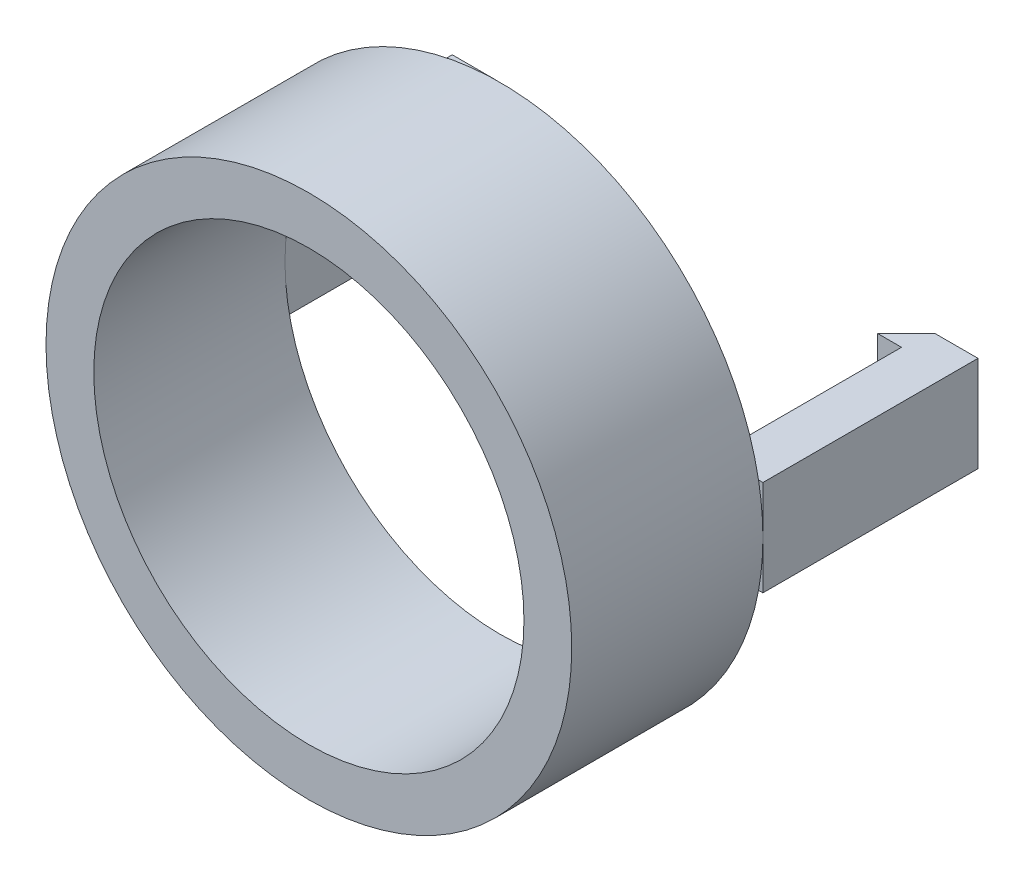
ISO-10303-21;
HEADER;
FILE_DESCRIPTION(('STEP AP214'),'2;1');
FILE_NAME('part.step','',(''),(''),'','','');
FILE_SCHEMA(('AUTOMOTIVE_DESIGN { 1 0 10303 214 1 1 1 1 }'));
ENDSEC;
DATA;
#1=APPLICATION_CONTEXT('core data for automotive mechanical design processes');
#2=APPLICATION_PROTOCOL_DEFINITION('international standard','automotive_design',2000,#1);
#3=PRODUCT_CONTEXT('',#1,'mechanical');
#4=PRODUCT('Part','Part','',(#3));
#5=PRODUCT_RELATED_PRODUCT_CATEGORY('part','',(#4));
#6=PRODUCT_DEFINITION_FORMATION('','',#4);
#7=PRODUCT_DEFINITION_CONTEXT('part definition',#1,'design');
#8=PRODUCT_DEFINITION('design','',#6,#7);
#9=PRODUCT_DEFINITION_SHAPE('','',#8);
#10=(LENGTH_UNIT() NAMED_UNIT(*) SI_UNIT(.MILLI.,.METRE.));
#11=(NAMED_UNIT(*) PLANE_ANGLE_UNIT() SI_UNIT($,.RADIAN.));
#12=(NAMED_UNIT(*) SI_UNIT($,.STERADIAN.) SOLID_ANGLE_UNIT());
#13=UNCERTAINTY_MEASURE_WITH_UNIT(LENGTH_MEASURE(1.E-05),#10,'distance_accuracy_value','');
#14=(GEOMETRIC_REPRESENTATION_CONTEXT(3) GLOBAL_UNCERTAINTY_ASSIGNED_CONTEXT((#13)) GLOBAL_UNIT_ASSIGNED_CONTEXT((#10,
#11,#12)) REPRESENTATION_CONTEXT('',''));
#15=CARTESIAN_POINT('',(0.,0.,0.));
#16=DIRECTION('',(0.,0.,1.));
#17=DIRECTION('',(1.,0.,0.));
#18=AXIS2_PLACEMENT_3D('',#15,#16,#17);
#19=CARTESIAN_POINT('',(0.,0.,0.));
#20=DIRECTION('',(0.,0.,1.));
#21=DIRECTION('',(1.,0.,0.));
#22=AXIS2_PLACEMENT_3D('',#19,#20,#21);
#23=PLANE('',#22);
#24=DIRECTION('',(0.,-1.,0.));
#25=VECTOR('',#24,1.);
#26=CARTESIAN_POINT('',(9.,2.,0.));
#27=LINE('',#26,#25);
#28=CARTESIAN_POINT('',(9.,0.,0.));
#29=VERTEX_POINT('',#28);
#30=CARTESIAN_POINT('',(9.,-2.,0.));
#31=VERTEX_POINT('',#30);
#32=EDGE_CURVE('E171',#29,#31,#27,.T.);
#33=ORIENTED_EDGE('',*,*,#32,.T.);
#34=DIRECTION('',(1.,0.,0.));
#35=VECTOR('',#34,1.);
#36=CARTESIAN_POINT('',(9.,-2.,0.));
#37=LINE('',#36,#35);
#38=CARTESIAN_POINT('',(10.816653826392,-2.,0.));
#39=VERTEX_POINT('',#38);
#40=EDGE_CURVE('E193',#31,#39,#37,.T.);
#41=ORIENTED_EDGE('',*,*,#40,.T.);
#42=CARTESIAN_POINT('',(0.,0.,0.));
#43=DIRECTION('',(0.,0.,1.));
#44=DIRECTION('',(1.,0.,0.));
#45=AXIS2_PLACEMENT_3D('',#42,#43,#44);
#46=CIRCLE('',#45,11.);
#47=CARTESIAN_POINT('',(-10.816653826392,-2.,0.));
#48=VERTEX_POINT('',#47);
#49=EDGE_CURVE('E278',#48,#39,#46,.T.);
#50=ORIENTED_EDGE('',*,*,#49,.F.);
#51=DIRECTION('',(1.,0.,0.));
#52=VECTOR('',#51,1.);
#53=CARTESIAN_POINT('',(-9.,-2.,0.));
#54=LINE('',#53,#52);
#55=CARTESIAN_POINT('',(-9.,-2.,0.));
#56=VERTEX_POINT('',#55);
#57=EDGE_CURVE('E11',#48,#56,#54,.T.);
#58=ORIENTED_EDGE('',*,*,#57,.T.);
#59=DIRECTION('',(0.,-1.,0.));
#60=VECTOR('',#59,1.);
#61=CARTESIAN_POINT('',(-9.,2.,0.));
#62=LINE('',#61,#60);
#63=CARTESIAN_POINT('',(-9.,0.,0.));
#64=VERTEX_POINT('',#63);
#65=EDGE_CURVE('E45',#64,#56,#62,.T.);
#66=ORIENTED_EDGE('',*,*,#65,.F.);
#67=CARTESIAN_POINT('',(0.,0.,0.));
#68=DIRECTION('',(0.,0.,1.));
#69=DIRECTION('',(1.,0.,0.));
#70=AXIS2_PLACEMENT_3D('',#67,#68,#69);
#71=CIRCLE('',#70,9.);
#72=EDGE_CURVE('E266',#64,#29,#71,.T.);
#73=ORIENTED_EDGE('',*,*,#72,.T.);
#74=EDGE_LOOP('',(#33,#41,#50,#58,#66,#73));
#75=FACE_BOUND('',#74,.T.);
#76=ADVANCED_FACE('F36',(#75),#23,.F.);
#77=CARTESIAN_POINT('',(0.,0.,8.));
#78=DIRECTION('',(0.,0.,1.));
#79=DIRECTION('',(1.,0.,0.));
#80=AXIS2_PLACEMENT_3D('',#77,#78,#79);
#81=PLANE('',#80);
#82=CARTESIAN_POINT('',(0.,0.,8.));
#83=DIRECTION('',(0.,0.,1.));
#84=DIRECTION('',(1.,0.,0.));
#85=AXIS2_PLACEMENT_3D('',#82,#83,#84);
#86=CIRCLE('',#85,11.);
#87=CARTESIAN_POINT('',(11.,0.,8.));
#88=VERTEX_POINT('',#87);
#89=EDGE_CURVE('E268',#88,#88,#86,.T.);
#90=ORIENTED_EDGE('',*,*,#89,.T.);
#91=EDGE_LOOP('',(#90));
#92=FACE_BOUND('',#91,.T.);
#93=CARTESIAN_POINT('',(0.,0.,8.));
#94=DIRECTION('',(0.,0.,1.));
#95=DIRECTION('',(1.,0.,0.));
#96=AXIS2_PLACEMENT_3D('',#93,#94,#95);
#97=CIRCLE('',#96,9.);
#98=CARTESIAN_POINT('',(9.,0.,8.));
#99=VERTEX_POINT('',#98);
#100=EDGE_CURVE('E263',#99,#99,#97,.T.);
#101=ORIENTED_EDGE('',*,*,#100,.F.);
#102=EDGE_LOOP('',(#101));
#103=FACE_BOUND('',#102,.T.);
#104=ADVANCED_FACE('F318',(#92,#103),#81,.T.);
#105=CARTESIAN_POINT('',(10.816653826392,2.,0.));
#106=VERTEX_POINT('',#105);
#107=CARTESIAN_POINT('',(-10.816653826392,2.,0.));
#108=VERTEX_POINT('',#107);
#109=EDGE_CURVE('E178',#106,#108,#46,.T.);
#110=ORIENTED_EDGE('',*,*,#109,.F.);
#111=DIRECTION('',(1.,0.,0.));
#112=VECTOR('',#111,1.);
#113=CARTESIAN_POINT('',(9.,2.,0.));
#114=LINE('',#113,#112);
#115=CARTESIAN_POINT('',(9.,2.,0.));
#116=VERTEX_POINT('',#115);
#117=EDGE_CURVE('E156',#116,#106,#114,.T.);
#118=ORIENTED_EDGE('',*,*,#117,.F.);
#119=EDGE_CURVE('E167',#116,#29,#27,.T.);
#120=ORIENTED_EDGE('',*,*,#119,.T.);
#121=EDGE_CURVE('E262',#29,#64,#71,.T.);
#122=ORIENTED_EDGE('',*,*,#121,.T.);
#123=CARTESIAN_POINT('',(-9.,2.,0.));
#124=VERTEX_POINT('',#123);
#125=EDGE_CURVE('E259',#124,#64,#62,.T.);
#126=ORIENTED_EDGE('',*,*,#125,.F.);
#127=DIRECTION('',(1.,0.,0.));
#128=VECTOR('',#127,1.);
#129=CARTESIAN_POINT('',(-9.,2.,0.));
#130=LINE('',#129,#128);
#131=EDGE_CURVE('E222',#108,#124,#130,.T.);
#132=ORIENTED_EDGE('',*,*,#131,.F.);
#133=EDGE_LOOP('',(#110,#118,#120,#122,#126,#132));
#134=FACE_BOUND('',#133,.T.);
#135=ADVANCED_FACE('F176',(#134),#23,.F.);
#136=CARTESIAN_POINT('',(0.,0.,8.));
#137=DIRECTION('',(0.,0.,-1.));
#138=DIRECTION('',(-1.,0.,0.));
#139=AXIS2_PLACEMENT_3D('',#136,#137,#138);
#140=CYLINDRICAL_SURFACE('',#139,11.);
#141=ORIENTED_EDGE('',*,*,#89,.F.);
#142=EDGE_LOOP('',(#141));
#143=FACE_BOUND('',#142,.T.);
#144=CARTESIAN_POINT('',(-11.,0.,0.));
#145=VERTEX_POINT('',#144);
#146=EDGE_CURVE('E40',#108,#145,#46,.T.);
#147=ORIENTED_EDGE('',*,*,#146,.T.);
#148=EDGE_CURVE('E273',#145,#48,#46,.T.);
#149=ORIENTED_EDGE('',*,*,#148,.T.);
#150=ORIENTED_EDGE('',*,*,#49,.T.);
#151=CARTESIAN_POINT('',(0.,0.,0.));
#152=DIRECTION('',(0.,0.,-1.));
#153=DIRECTION('',(-1.,0.,0.));
#154=AXIS2_PLACEMENT_3D('',#151,#152,#153);
#155=CIRCLE('',#154,11.);
#156=CARTESIAN_POINT('',(11.,0.,0.));
#157=VERTEX_POINT('',#156);
#158=EDGE_CURVE('E174',#157,#39,#155,.T.);
#159=ORIENTED_EDGE('',*,*,#158,.F.);
#160=EDGE_CURVE('E216',#106,#157,#155,.T.);
#161=ORIENTED_EDGE('',*,*,#160,.F.);
#162=ORIENTED_EDGE('',*,*,#109,.T.);
#163=EDGE_LOOP('',(#147,#149,#150,#159,#161,#162));
#164=FACE_BOUND('',#163,.T.);
#165=ADVANCED_FACE('F38',(#143,#164),#140,.T.);
#166=CARTESIAN_POINT('',(0.,0.,8.));
#167=DIRECTION('',(0.,0.,-1.));
#168=DIRECTION('',(-1.,0.,0.));
#169=AXIS2_PLACEMENT_3D('',#166,#167,#168);
#170=CYLINDRICAL_SURFACE('',#169,9.);
#171=ORIENTED_EDGE('',*,*,#100,.T.);
#172=EDGE_LOOP('',(#171));
#173=FACE_BOUND('',#172,.T.);
#174=ORIENTED_EDGE('',*,*,#72,.F.);
#175=ORIENTED_EDGE('',*,*,#121,.F.);
#176=EDGE_LOOP('',(#174,#175));
#177=FACE_BOUND('',#176,.T.);
#178=ADVANCED_FACE('F327',(#173,#177),#170,.F.);
#179=CARTESIAN_POINT('',(-9.,2.,0.));
#180=DIRECTION('',(0.,0.,-1.));
#181=DIRECTION('',(-1.,0.,0.));
#182=AXIS2_PLACEMENT_3D('',#179,#180,#181);
#183=PLANE('',#182);
#184=ORIENTED_EDGE('',*,*,#146,.F.);
#185=CARTESIAN_POINT('',(-11.,2.,0.));
#186=VERTEX_POINT('',#185);
#187=EDGE_CURVE('E217',#186,#108,#130,.T.);
#188=ORIENTED_EDGE('',*,*,#187,.F.);
#189=DIRECTION('',(0.,-1.,0.));
#190=VECTOR('',#189,1.);
#191=CARTESIAN_POINT('',(-11.,2.,0.));
#192=LINE('',#191,#190);
#193=EDGE_CURVE('E244',#186,#145,#192,.T.);
#194=ORIENTED_EDGE('',*,*,#193,.T.);
#195=EDGE_LOOP('',(#184,#188,#194));
#196=FACE_BOUND('',#195,.T.);
#197=ADVANCED_FACE('F332',(#196),#183,.F.);
#198=ORIENTED_EDGE('',*,*,#148,.F.);
#199=CARTESIAN_POINT('',(-11.,-2.,0.));
#200=VERTEX_POINT('',#199);
#201=EDGE_CURVE('E231',#145,#200,#192,.T.);
#202=ORIENTED_EDGE('',*,*,#201,.T.);
#203=EDGE_CURVE('E47',#200,#48,#54,.T.);
#204=ORIENTED_EDGE('',*,*,#203,.T.);
#205=EDGE_LOOP('',(#198,#202,#204));
#206=FACE_BOUND('',#205,.T.);
#207=ADVANCED_FACE('F338',(#206),#183,.F.);
#208=CARTESIAN_POINT('',(-9.,2.,-7.8));
#209=DIRECTION('',(-1.,0.,0.));
#210=DIRECTION('',(0.,0.,1.));
#211=AXIS2_PLACEMENT_3D('',#208,#209,#210);
#212=PLANE('',#211);
#213=DIRECTION('',(0.,0.,-1.));
#214=VECTOR('',#213,1.);
#215=CARTESIAN_POINT('',(-9.,-2.,-7.8));
#216=LINE('',#215,#214);
#217=CARTESIAN_POINT('',(-9.,-2.,-7.8));
#218=VERTEX_POINT('',#217);
#219=EDGE_CURVE('E234',#56,#218,#216,.T.);
#220=ORIENTED_EDGE('',*,*,#219,.T.);
#221=DIRECTION('',(0.,-1.,0.));
#222=VECTOR('',#221,1.);
#223=CARTESIAN_POINT('',(-9.,2.,-7.8));
#224=LINE('',#223,#222);
#225=CARTESIAN_POINT('',(-9.,2.,-7.8));
#226=VERTEX_POINT('',#225);
#227=EDGE_CURVE('E256',#226,#218,#224,.T.);
#228=ORIENTED_EDGE('',*,*,#227,.F.);
#229=DIRECTION('',(0.,0.,-1.));
#230=VECTOR('',#229,1.);
#231=CARTESIAN_POINT('',(-9.,2.,-7.8));
#232=LINE('',#231,#230);
#233=EDGE_CURVE('E220',#124,#226,#232,.T.);
#234=ORIENTED_EDGE('',*,*,#233,.F.);
#235=ORIENTED_EDGE('',*,*,#125,.T.);
#236=ORIENTED_EDGE('',*,*,#65,.T.);
#237=EDGE_LOOP('',(#220,#228,#234,#235,#236));
#238=FACE_BOUND('',#237,.T.);
#239=ADVANCED_FACE('F344',(#238),#212,.F.);
#240=CARTESIAN_POINT('',(-8.,2.,-7.8));
#241=DIRECTION('',(0.,0.,-1.));
#242=DIRECTION('',(-1.,0.,0.));
#243=AXIS2_PLACEMENT_3D('',#240,#241,#242);
#244=PLANE('',#243);
#245=DIRECTION('',(1.,0.,0.));
#246=VECTOR('',#245,1.);
#247=CARTESIAN_POINT('',(-8.,-2.,-7.8));
#248=LINE('',#247,#246);
#249=CARTESIAN_POINT('',(-8.,-2.,-7.8));
#250=VERTEX_POINT('',#249);
#251=EDGE_CURVE('E236',#218,#250,#248,.T.);
#252=ORIENTED_EDGE('',*,*,#251,.T.);
#253=DIRECTION('',(0.,-1.,0.));
#254=VECTOR('',#253,1.);
#255=CARTESIAN_POINT('',(-8.,2.,-7.8));
#256=LINE('',#255,#254);
#257=CARTESIAN_POINT('',(-8.,2.,-7.8));
#258=VERTEX_POINT('',#257);
#259=EDGE_CURVE('E253',#258,#250,#256,.T.);
#260=ORIENTED_EDGE('',*,*,#259,.F.);
#261=DIRECTION('',(1.,0.,0.));
#262=VECTOR('',#261,1.);
#263=CARTESIAN_POINT('',(-8.,2.,-7.8));
#264=LINE('',#263,#262);
#265=EDGE_CURVE('E224',#226,#258,#264,.T.);
#266=ORIENTED_EDGE('',*,*,#265,.F.);
#267=ORIENTED_EDGE('',*,*,#227,.T.);
#268=EDGE_LOOP('',(#252,#260,#266,#267));
#269=FACE_BOUND('',#268,.T.);
#270=ADVANCED_FACE('F348',(#269),#244,.F.);
#271=CARTESIAN_POINT('',(-9.20000000000001,2.,-9.));
#272=DIRECTION('',(-0.707106781186544,0.,0.707106781186551));
#273=DIRECTION('',(0.707106781186551,0.,0.707106781186544));
#274=AXIS2_PLACEMENT_3D('',#271,#272,#273);
#275=PLANE('',#274);
#276=DIRECTION('',(-0.707106781186551,0.,-0.707106781186544));
#277=VECTOR('',#276,1.);
#278=CARTESIAN_POINT('',(-9.20000000000001,-2.,-9.));
#279=LINE('',#278,#277);
#280=CARTESIAN_POINT('',(-9.20000000000001,-2.,-9.));
#281=VERTEX_POINT('',#280);
#282=EDGE_CURVE('E238',#250,#281,#279,.T.);
#283=ORIENTED_EDGE('',*,*,#282,.T.);
#284=DIRECTION('',(0.,-1.,0.));
#285=VECTOR('',#284,1.);
#286=CARTESIAN_POINT('',(-9.20000000000001,2.,-9.));
#287=LINE('',#286,#285);
#288=CARTESIAN_POINT('',(-9.20000000000001,2.,-9.));
#289=VERTEX_POINT('',#288);
#290=EDGE_CURVE('E250',#289,#281,#287,.T.);
#291=ORIENTED_EDGE('',*,*,#290,.F.);
#292=DIRECTION('',(-0.707106781186551,0.,-0.707106781186544));
#293=VECTOR('',#292,1.);
#294=CARTESIAN_POINT('',(-9.20000000000001,2.,-9.));
#295=LINE('',#294,#293);
#296=EDGE_CURVE('E226',#258,#289,#295,.T.);
#297=ORIENTED_EDGE('',*,*,#296,.F.);
#298=ORIENTED_EDGE('',*,*,#259,.T.);
#299=EDGE_LOOP('',(#283,#291,#297,#298));
#300=FACE_BOUND('',#299,.T.);
#301=ADVANCED_FACE('F352',(#300),#275,.F.);
#302=CARTESIAN_POINT('',(-11.,2.,-9.));
#303=DIRECTION('',(0.,0.,1.));
#304=DIRECTION('',(1.,0.,0.));
#305=AXIS2_PLACEMENT_3D('',#302,#303,#304);
#306=PLANE('',#305);
#307=DIRECTION('',(-1.,0.,0.));
#308=VECTOR('',#307,1.);
#309=CARTESIAN_POINT('',(-11.,-2.,-9.));
#310=LINE('',#309,#308);
#311=CARTESIAN_POINT('',(-11.,-2.,-9.));
#312=VERTEX_POINT('',#311);
#313=EDGE_CURVE('E240',#281,#312,#310,.T.);
#314=ORIENTED_EDGE('',*,*,#313,.T.);
#315=DIRECTION('',(0.,-1.,0.));
#316=VECTOR('',#315,1.);
#317=CARTESIAN_POINT('',(-11.,2.,-9.));
#318=LINE('',#317,#316);
#319=CARTESIAN_POINT('',(-11.,2.,-9.));
#320=VERTEX_POINT('',#319);
#321=EDGE_CURVE('E247',#320,#312,#318,.T.);
#322=ORIENTED_EDGE('',*,*,#321,.F.);
#323=DIRECTION('',(-1.,0.,0.));
#324=VECTOR('',#323,1.);
#325=CARTESIAN_POINT('',(-11.,2.,-9.));
#326=LINE('',#325,#324);
#327=EDGE_CURVE('E228',#289,#320,#326,.T.);
#328=ORIENTED_EDGE('',*,*,#327,.F.);
#329=ORIENTED_EDGE('',*,*,#290,.T.);
#330=EDGE_LOOP('',(#314,#322,#328,#329));
#331=FACE_BOUND('',#330,.T.);
#332=ADVANCED_FACE('F356',(#331),#306,.F.);
#333=CARTESIAN_POINT('',(-11.,2.,0.));
#334=DIRECTION('',(1.,0.,0.));
#335=DIRECTION('',(0.,0.,-1.));
#336=AXIS2_PLACEMENT_3D('',#333,#334,#335);
#337=PLANE('',#336);
#338=DIRECTION('',(0.,0.,1.));
#339=VECTOR('',#338,1.);
#340=CARTESIAN_POINT('',(-11.,-2.,0.));
#341=LINE('',#340,#339);
#342=EDGE_CURVE('E221',#312,#200,#341,.T.);
#343=ORIENTED_EDGE('',*,*,#342,.T.);
#344=ORIENTED_EDGE('',*,*,#201,.F.);
#345=ORIENTED_EDGE('',*,*,#193,.F.);
#346=DIRECTION('',(0.,0.,1.));
#347=VECTOR('',#346,1.);
#348=CARTESIAN_POINT('',(-11.,2.,0.));
#349=LINE('',#348,#347);
#350=EDGE_CURVE('E230',#320,#186,#349,.T.);
#351=ORIENTED_EDGE('',*,*,#350,.F.);
#352=ORIENTED_EDGE('',*,*,#321,.T.);
#353=EDGE_LOOP('',(#343,#344,#345,#351,#352));
#354=FACE_BOUND('',#353,.T.);
#355=ADVANCED_FACE('F360',(#354),#337,.F.);
#356=CARTESIAN_POINT('',(0.,2.,0.));
#357=DIRECTION('',(0.,-1.,0.));
#358=DIRECTION('',(0.,0.,-1.));
#359=AXIS2_PLACEMENT_3D('',#356,#357,#358);
#360=PLANE('',#359);
#361=ORIENTED_EDGE('',*,*,#187,.T.);
#362=ORIENTED_EDGE('',*,*,#131,.T.);
#363=ORIENTED_EDGE('',*,*,#233,.T.);
#364=ORIENTED_EDGE('',*,*,#265,.T.);
#365=ORIENTED_EDGE('',*,*,#296,.T.);
#366=ORIENTED_EDGE('',*,*,#327,.T.);
#367=ORIENTED_EDGE('',*,*,#350,.T.);
#368=EDGE_LOOP('',(#361,#362,#363,#364,#365,#366,#367));
#369=FACE_BOUND('',#368,.T.);
#370=ADVANCED_FACE('F364',(#369),#360,.F.);
#371=CARTESIAN_POINT('',(0.,-2.,0.));
#372=DIRECTION('',(0.,-1.,0.));
#373=DIRECTION('',(0.,0.,-1.));
#374=AXIS2_PLACEMENT_3D('',#371,#372,#373);
#375=PLANE('',#374);
#376=ORIENTED_EDGE('',*,*,#203,.F.);
#377=ORIENTED_EDGE('',*,*,#342,.F.);
#378=ORIENTED_EDGE('',*,*,#313,.F.);
#379=ORIENTED_EDGE('',*,*,#282,.F.);
#380=ORIENTED_EDGE('',*,*,#251,.F.);
#381=ORIENTED_EDGE('',*,*,#219,.F.);
#382=ORIENTED_EDGE('',*,*,#57,.F.);
#383=EDGE_LOOP('',(#376,#377,#378,#379,#380,#381,#382));
#384=FACE_BOUND('',#383,.T.);
#385=ADVANCED_FACE('F315',(#384),#375,.T.);
#386=CARTESIAN_POINT('',(9.,2.,0.));
#387=DIRECTION('',(0.,0.,-1.));
#388=DIRECTION('',(-1.,0.,0.));
#389=AXIS2_PLACEMENT_3D('',#386,#387,#388);
#390=PLANE('',#389);
#391=CARTESIAN_POINT('',(11.,2.,0.));
#392=VERTEX_POINT('',#391);
#393=EDGE_CURVE('E163',#106,#392,#114,.T.);
#394=ORIENTED_EDGE('',*,*,#393,.F.);
#395=ORIENTED_EDGE('',*,*,#160,.T.);
#396=DIRECTION('',(0.,-1.,0.));
#397=VECTOR('',#396,1.);
#398=CARTESIAN_POINT('',(11.,2.,0.));
#399=LINE('',#398,#397);
#400=EDGE_CURVE('E54',#392,#157,#399,.T.);
#401=ORIENTED_EDGE('',*,*,#400,.F.);
#402=EDGE_LOOP('',(#394,#395,#401));
#403=FACE_BOUND('',#402,.T.);
#404=ADVANCED_FACE('F307',(#403),#390,.F.);
#405=CARTESIAN_POINT('',(9.,2.,-7.8));
#406=DIRECTION('',(1.,0.,0.));
#407=DIRECTION('',(0.,0.,-1.));
#408=AXIS2_PLACEMENT_3D('',#405,#406,#407);
#409=PLANE('',#408);
#410=DIRECTION('',(0.,0.,1.));
#411=VECTOR('',#410,1.);
#412=CARTESIAN_POINT('',(9.,-2.,-7.8));
#413=LINE('',#412,#411);
#414=CARTESIAN_POINT('',(9.,-2.,-7.8));
#415=VERTEX_POINT('',#414);
#416=EDGE_CURVE('E190',#415,#31,#413,.T.);
#417=ORIENTED_EDGE('',*,*,#416,.T.);
#418=ORIENTED_EDGE('',*,*,#32,.F.);
#419=ORIENTED_EDGE('',*,*,#119,.F.);
#420=DIRECTION('',(0.,0.,1.));
#421=VECTOR('',#420,1.);
#422=CARTESIAN_POINT('',(9.,2.,-7.8));
#423=LINE('',#422,#421);
#424=CARTESIAN_POINT('',(9.,2.,-7.8));
#425=VERTEX_POINT('',#424);
#426=EDGE_CURVE('E152',#425,#116,#423,.T.);
#427=ORIENTED_EDGE('',*,*,#426,.F.);
#428=DIRECTION('',(0.,-1.,0.));
#429=VECTOR('',#428,1.);
#430=CARTESIAN_POINT('',(9.,2.,-7.8));
#431=LINE('',#430,#429);
#432=EDGE_CURVE('E189',#425,#415,#431,.T.);
#433=ORIENTED_EDGE('',*,*,#432,.T.);
#434=EDGE_LOOP('',(#417,#418,#419,#427,#433));
#435=FACE_BOUND('',#434,.T.);
#436=ADVANCED_FACE('F169',(#435),#409,.F.);
#437=CARTESIAN_POINT('',(11.,-2.,0.));
#438=VERTEX_POINT('',#437);
#439=EDGE_CURVE('E213',#157,#438,#399,.T.);
#440=ORIENTED_EDGE('',*,*,#439,.F.);
#441=ORIENTED_EDGE('',*,*,#158,.T.);
#442=EDGE_CURVE('E192',#39,#438,#37,.T.);
#443=ORIENTED_EDGE('',*,*,#442,.T.);
#444=EDGE_LOOP('',(#440,#441,#443));
#445=FACE_BOUND('',#444,.T.);
#446=ADVANCED_FACE('F304',(#445),#390,.F.);
#447=CARTESIAN_POINT('',(11.,2.,0.));
#448=DIRECTION('',(-1.,0.,0.));
#449=DIRECTION('',(0.,0.,1.));
#450=AXIS2_PLACEMENT_3D('',#447,#448,#449);
#451=PLANE('',#450);
#452=DIRECTION('',(0.,0.,-1.));
#453=VECTOR('',#452,1.);
#454=CARTESIAN_POINT('',(11.,-2.,0.));
#455=LINE('',#454,#453);
#456=CARTESIAN_POINT('',(11.,-2.,-9.));
#457=VERTEX_POINT('',#456);
#458=EDGE_CURVE('E196',#438,#457,#455,.T.);
#459=ORIENTED_EDGE('',*,*,#458,.T.);
#460=DIRECTION('',(0.,-1.,0.));
#461=VECTOR('',#460,1.);
#462=CARTESIAN_POINT('',(11.,2.,-9.));
#463=LINE('',#462,#461);
#464=CARTESIAN_POINT('',(11.,2.,-9.));
#465=VERTEX_POINT('',#464);
#466=EDGE_CURVE('E210',#465,#457,#463,.T.);
#467=ORIENTED_EDGE('',*,*,#466,.F.);
#468=DIRECTION('',(0.,0.,-1.));
#469=VECTOR('',#468,1.);
#470=CARTESIAN_POINT('',(11.,2.,0.));
#471=LINE('',#470,#469);
#472=EDGE_CURVE('E180',#392,#465,#471,.T.);
#473=ORIENTED_EDGE('',*,*,#472,.F.);
#474=ORIENTED_EDGE('',*,*,#400,.T.);
#475=ORIENTED_EDGE('',*,*,#439,.T.);
#476=EDGE_LOOP('',(#459,#467,#473,#474,#475));
#477=FACE_BOUND('',#476,.T.);
#478=ADVANCED_FACE('F301',(#477),#451,.F.);
#479=CARTESIAN_POINT('',(11.,2.,-9.));
#480=DIRECTION('',(0.,0.,1.));
#481=DIRECTION('',(1.,0.,0.));
#482=AXIS2_PLACEMENT_3D('',#479,#480,#481);
#483=PLANE('',#482);
#484=DIRECTION('',(-1.,0.,0.));
#485=VECTOR('',#484,1.);
#486=CARTESIAN_POINT('',(11.,-2.,-9.));
#487=LINE('',#486,#485);
#488=CARTESIAN_POINT('',(9.20000000000001,-2.,-9.));
#489=VERTEX_POINT('',#488);
#490=EDGE_CURVE('E198',#457,#489,#487,.T.);
#491=ORIENTED_EDGE('',*,*,#490,.T.);
#492=DIRECTION('',(0.,-1.,0.));
#493=VECTOR('',#492,1.);
#494=CARTESIAN_POINT('',(9.20000000000001,2.,-9.));
#495=LINE('',#494,#493);
#496=CARTESIAN_POINT('',(9.20000000000001,2.,-9.));
#497=VERTEX_POINT('',#496);
#498=EDGE_CURVE('E207',#497,#489,#495,.T.);
#499=ORIENTED_EDGE('',*,*,#498,.F.);
#500=DIRECTION('',(-1.,0.,0.));
#501=VECTOR('',#500,1.);
#502=CARTESIAN_POINT('',(11.,2.,-9.));
#503=LINE('',#502,#501);
#504=EDGE_CURVE('E182',#465,#497,#503,.T.);
#505=ORIENTED_EDGE('',*,*,#504,.F.);
#506=ORIENTED_EDGE('',*,*,#466,.T.);
#507=EDGE_LOOP('',(#491,#499,#505,#506));
#508=FACE_BOUND('',#507,.T.);
#509=ADVANCED_FACE('F299',(#508),#483,.F.);
#510=CARTESIAN_POINT('',(9.20000000000001,2.,-9.));
#511=DIRECTION('',(0.707106781186544,0.,0.707106781186551));
#512=DIRECTION('',(0.707106781186551,0.,-0.707106781186544));
#513=AXIS2_PLACEMENT_3D('',#510,#511,#512);
#514=PLANE('',#513);
#515=DIRECTION('',(-0.707106781186551,0.,0.707106781186544));
#516=VECTOR('',#515,1.);
#517=CARTESIAN_POINT('',(9.20000000000001,-2.,-9.));
#518=LINE('',#517,#516);
#519=CARTESIAN_POINT('',(8.,-2.,-7.8));
#520=VERTEX_POINT('',#519);
#521=EDGE_CURVE('E200',#489,#520,#518,.T.);
#522=ORIENTED_EDGE('',*,*,#521,.T.);
#523=DIRECTION('',(0.,-1.,0.));
#524=VECTOR('',#523,1.);
#525=CARTESIAN_POINT('',(8.,2.,-7.8));
#526=LINE('',#525,#524);
#527=CARTESIAN_POINT('',(8.,2.,-7.8));
#528=VERTEX_POINT('',#527);
#529=EDGE_CURVE('E204',#528,#520,#526,.T.);
#530=ORIENTED_EDGE('',*,*,#529,.F.);
#531=DIRECTION('',(-0.707106781186551,0.,0.707106781186544));
#532=VECTOR('',#531,1.);
#533=CARTESIAN_POINT('',(9.20000000000001,2.,-9.));
#534=LINE('',#533,#532);
#535=EDGE_CURVE('E186',#497,#528,#534,.T.);
#536=ORIENTED_EDGE('',*,*,#535,.F.);
#537=ORIENTED_EDGE('',*,*,#498,.T.);
#538=EDGE_LOOP('',(#522,#530,#536,#537));
#539=FACE_BOUND('',#538,.T.);
#540=ADVANCED_FACE('F294',(#539),#514,.F.);
#541=CARTESIAN_POINT('',(8.,2.,-7.8));
#542=DIRECTION('',(0.,0.,-1.));
#543=DIRECTION('',(-1.,0.,0.));
#544=AXIS2_PLACEMENT_3D('',#541,#542,#543);
#545=PLANE('',#544);
#546=DIRECTION('',(1.,0.,0.));
#547=VECTOR('',#546,1.);
#548=CARTESIAN_POINT('',(8.,-2.,-7.8));
#549=LINE('',#548,#547);
#550=EDGE_CURVE('E164',#520,#415,#549,.T.);
#551=ORIENTED_EDGE('',*,*,#550,.T.);
#552=ORIENTED_EDGE('',*,*,#432,.F.);
#553=DIRECTION('',(1.,0.,0.));
#554=VECTOR('',#553,1.);
#555=CARTESIAN_POINT('',(8.,2.,-7.8));
#556=LINE('',#555,#554);
#557=EDGE_CURVE('E159',#528,#425,#556,.T.);
#558=ORIENTED_EDGE('',*,*,#557,.F.);
#559=ORIENTED_EDGE('',*,*,#529,.T.);
#560=EDGE_LOOP('',(#551,#552,#558,#559));
#561=FACE_BOUND('',#560,.T.);
#562=ADVANCED_FACE('F289',(#561),#545,.F.);
#563=CARTESIAN_POINT('',(0.,2.,0.));
#564=DIRECTION('',(0.,1.,0.));
#565=DIRECTION('',(0.,0.,1.));
#566=AXIS2_PLACEMENT_3D('',#563,#564,#565);
#567=PLANE('',#566);
#568=ORIENTED_EDGE('',*,*,#426,.T.);
#569=ORIENTED_EDGE('',*,*,#117,.T.);
#570=ORIENTED_EDGE('',*,*,#393,.T.);
#571=ORIENTED_EDGE('',*,*,#472,.T.);
#572=ORIENTED_EDGE('',*,*,#504,.T.);
#573=ORIENTED_EDGE('',*,*,#535,.T.);
#574=ORIENTED_EDGE('',*,*,#557,.T.);
#575=EDGE_LOOP('',(#568,#569,#570,#571,#572,#573,#574));
#576=FACE_BOUND('',#575,.T.);
#577=ADVANCED_FACE('F154',(#576),#567,.T.);
#578=CARTESIAN_POINT('',(0.,-2.,0.));
#579=DIRECTION('',(0.,1.,0.));
#580=DIRECTION('',(0.,0.,1.));
#581=AXIS2_PLACEMENT_3D('',#578,#579,#580);
#582=PLANE('',#581);
#583=ORIENTED_EDGE('',*,*,#416,.F.);
#584=ORIENTED_EDGE('',*,*,#550,.F.);
#585=ORIENTED_EDGE('',*,*,#521,.F.);
#586=ORIENTED_EDGE('',*,*,#490,.F.);
#587=ORIENTED_EDGE('',*,*,#458,.F.);
#588=ORIENTED_EDGE('',*,*,#442,.F.);
#589=ORIENTED_EDGE('',*,*,#40,.F.);
#590=EDGE_LOOP('',(#583,#584,#585,#586,#587,#588,#589));
#591=FACE_BOUND('',#590,.T.);
#592=ADVANCED_FACE('F284',(#591),#582,.F.);
#593=CLOSED_SHELL('',(#76,#104,#135,#165,#178,#197,#207,#239,#270,#301,#332,#355,#370,#385,#404,
#436,#446,#478,#509,#540,#562,#577,#592));
#594=MANIFOLD_SOLID_BREP('B2',#593);
#595=ADVANCED_BREP_SHAPE_REPRESENTATION('',(#18,#594),#14);
#596=SHAPE_DEFINITION_REPRESENTATION(#9,#595);
ENDSEC;
END-ISO-10303-21;
